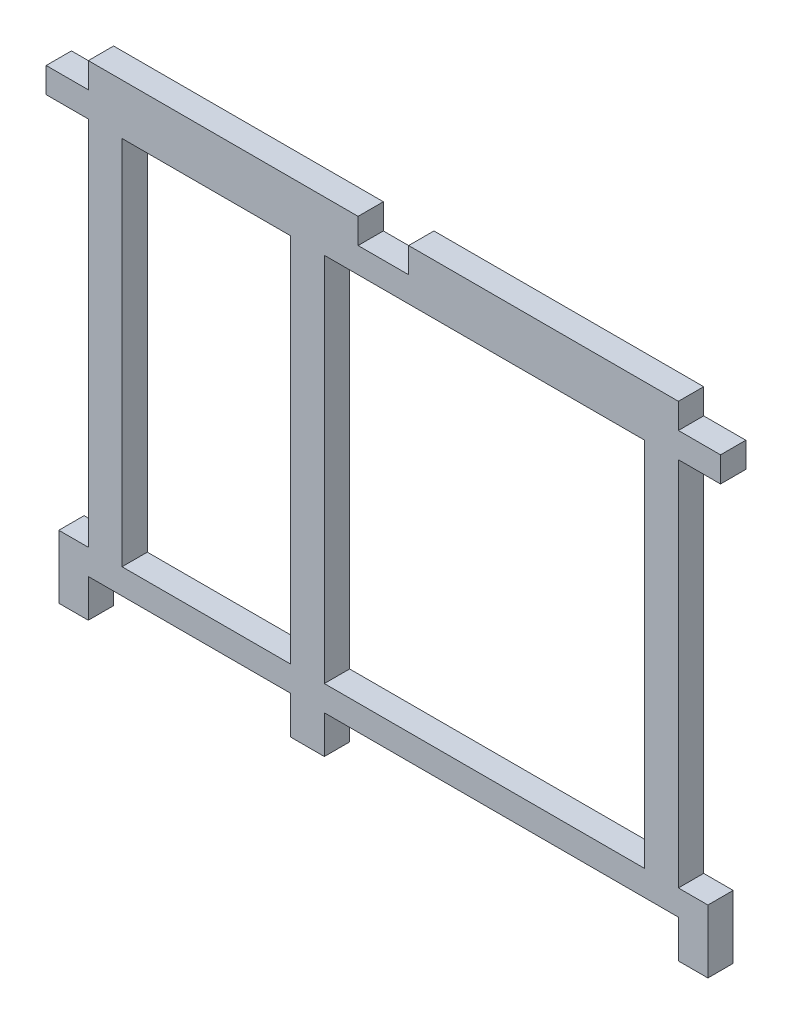
ISO-10303-21;
HEADER;
FILE_DESCRIPTION(('STEP AP214'),'2;1');
FILE_NAME('part.step','',(''),(''),'','','');
FILE_SCHEMA(('AUTOMOTIVE_DESIGN { 1 0 10303 214 1 1 1 1 }'));
ENDSEC;
DATA;
#1=APPLICATION_CONTEXT('core data for automotive mechanical design processes');
#2=APPLICATION_PROTOCOL_DEFINITION('international standard','automotive_design',2000,#1);
#3=PRODUCT_CONTEXT('',#1,'mechanical');
#4=PRODUCT('Part','Part','',(#3));
#5=PRODUCT_RELATED_PRODUCT_CATEGORY('part','',(#4));
#6=PRODUCT_DEFINITION_FORMATION('','',#4);
#7=PRODUCT_DEFINITION_CONTEXT('part definition',#1,'design');
#8=PRODUCT_DEFINITION('design','',#6,#7);
#9=PRODUCT_DEFINITION_SHAPE('','',#8);
#10=(LENGTH_UNIT() NAMED_UNIT(*) SI_UNIT(.MILLI.,.METRE.));
#11=(NAMED_UNIT(*) PLANE_ANGLE_UNIT() SI_UNIT($,.RADIAN.));
#12=(NAMED_UNIT(*) SI_UNIT($,.STERADIAN.) SOLID_ANGLE_UNIT());
#13=UNCERTAINTY_MEASURE_WITH_UNIT(LENGTH_MEASURE(1.E-05),#10,'distance_accuracy_value','');
#14=(GEOMETRIC_REPRESENTATION_CONTEXT(3) GLOBAL_UNCERTAINTY_ASSIGNED_CONTEXT((#13)) GLOBAL_UNIT_ASSIGNED_CONTEXT((#10,
#11,#12)) REPRESENTATION_CONTEXT('',''));
#15=CARTESIAN_POINT('',(0.,0.,0.));
#16=DIRECTION('',(0.,0.,1.));
#17=DIRECTION('',(1.,0.,0.));
#18=AXIS2_PLACEMENT_3D('',#15,#16,#17);
#19=CARTESIAN_POINT('',(0.,0.,3.));
#20=DIRECTION('',(0.,0.,1.));
#21=DIRECTION('',(1.,0.,0.));
#22=AXIS2_PLACEMENT_3D('',#19,#20,#21);
#23=PLANE('',#22);
#24=DIRECTION('',(0.,-1.,0.));
#25=VECTOR('',#24,1.);
#26=CARTESIAN_POINT('',(5.,-3.,3.));
#27=LINE('',#26,#25);
#28=CARTESIAN_POINT('',(5.,-3.,3.));
#29=VERTEX_POINT('',#28);
#30=CARTESIAN_POINT('',(5.,-47.,3.));
#31=VERTEX_POINT('',#30);
#32=EDGE_CURVE('E335',#29,#31,#27,.T.);
#33=ORIENTED_EDGE('',*,*,#32,.T.);
#34=DIRECTION('',(-1.,0.,0.));
#35=VECTOR('',#34,1.);
#36=CARTESIAN_POINT('',(1.5,-47.,3.));
#37=LINE('',#36,#35);
#38=CARTESIAN_POINT('',(1.5,-47.,3.));
#39=VERTEX_POINT('',#38);
#40=EDGE_CURVE('E338',#31,#39,#37,.T.);
#41=ORIENTED_EDGE('',*,*,#40,.T.);
#42=DIRECTION('',(0.,-1.,0.));
#43=VECTOR('',#42,1.);
#44=CARTESIAN_POINT('',(1.5,-54.5,3.));
#45=LINE('',#44,#43);
#46=CARTESIAN_POINT('',(1.5,-54.5,3.));
#47=VERTEX_POINT('',#46);
#48=EDGE_CURVE('E341',#39,#47,#45,.T.);
#49=ORIENTED_EDGE('',*,*,#48,.T.);
#50=DIRECTION('',(1.,0.,0.));
#51=VECTOR('',#50,1.);
#52=CARTESIAN_POINT('',(5.,-54.5,3.));
#53=LINE('',#52,#51);
#54=CARTESIAN_POINT('',(5.,-54.5,3.));
#55=VERTEX_POINT('',#54);
#56=EDGE_CURVE('E343',#47,#55,#53,.T.);
#57=ORIENTED_EDGE('',*,*,#56,.T.);
#58=DIRECTION('',(0.,1.,0.));
#59=VECTOR('',#58,1.);
#60=CARTESIAN_POINT('',(5.,-50.,3.));
#61=LINE('',#60,#59);
#62=CARTESIAN_POINT('',(5.,-50.,3.));
#63=VERTEX_POINT('',#62);
#64=EDGE_CURVE('E345',#55,#63,#61,.T.);
#65=ORIENTED_EDGE('',*,*,#64,.T.);
#66=DIRECTION('',(1.,0.,0.));
#67=VECTOR('',#66,1.);
#68=CARTESIAN_POINT('',(29.,-50.,3.));
#69=LINE('',#68,#67);
#70=CARTESIAN_POINT('',(29.,-50.,3.));
#71=VERTEX_POINT('',#70);
#72=EDGE_CURVE('E347',#63,#71,#69,.T.);
#73=ORIENTED_EDGE('',*,*,#72,.T.);
#74=DIRECTION('',(0.,-1.,0.));
#75=VECTOR('',#74,1.);
#76=CARTESIAN_POINT('',(29.,-54.5,3.));
#77=LINE('',#76,#75);
#78=CARTESIAN_POINT('',(29.,-54.5,3.));
#79=VERTEX_POINT('',#78);
#80=EDGE_CURVE('E349',#71,#79,#77,.T.);
#81=ORIENTED_EDGE('',*,*,#80,.T.);
#82=DIRECTION('',(1.,0.,0.));
#83=VECTOR('',#82,1.);
#84=CARTESIAN_POINT('',(33.,-54.5,3.));
#85=LINE('',#84,#83);
#86=CARTESIAN_POINT('',(33.,-54.5,3.));
#87=VERTEX_POINT('',#86);
#88=EDGE_CURVE('E351',#79,#87,#85,.T.);
#89=ORIENTED_EDGE('',*,*,#88,.T.);
#90=DIRECTION('',(0.,1.,0.));
#91=VECTOR('',#90,1.);
#92=CARTESIAN_POINT('',(33.,-50.,3.));
#93=LINE('',#92,#91);
#94=CARTESIAN_POINT('',(33.,-50.,3.));
#95=VERTEX_POINT('',#94);
#96=EDGE_CURVE('E353',#87,#95,#93,.T.);
#97=ORIENTED_EDGE('',*,*,#96,.T.);
#98=DIRECTION('',(1.,0.,0.));
#99=VECTOR('',#98,1.);
#100=CARTESIAN_POINT('',(75.,-50.,3.));
#101=LINE('',#100,#99);
#102=CARTESIAN_POINT('',(75.,-50.,3.));
#103=VERTEX_POINT('',#102);
#104=EDGE_CURVE('E355',#95,#103,#101,.T.);
#105=ORIENTED_EDGE('',*,*,#104,.T.);
#106=DIRECTION('',(0.,-1.,0.));
#107=VECTOR('',#106,1.);
#108=CARTESIAN_POINT('',(75.,-54.5,3.));
#109=LINE('',#108,#107);
#110=CARTESIAN_POINT('',(75.,-54.5,3.));
#111=VERTEX_POINT('',#110);
#112=EDGE_CURVE('E357',#103,#111,#109,.T.);
#113=ORIENTED_EDGE('',*,*,#112,.T.);
#114=DIRECTION('',(1.,0.,0.));
#115=VECTOR('',#114,1.);
#116=CARTESIAN_POINT('',(78.5,-54.5,3.));
#117=LINE('',#116,#115);
#118=CARTESIAN_POINT('',(78.5,-54.5,3.));
#119=VERTEX_POINT('',#118);
#120=EDGE_CURVE('E359',#111,#119,#117,.T.);
#121=ORIENTED_EDGE('',*,*,#120,.T.);
#122=DIRECTION('',(0.,1.,0.));
#123=VECTOR('',#122,1.);
#124=CARTESIAN_POINT('',(78.5,-47.,3.));
#125=LINE('',#124,#123);
#126=CARTESIAN_POINT('',(78.5,-47.,3.));
#127=VERTEX_POINT('',#126);
#128=EDGE_CURVE('E361',#119,#127,#125,.T.);
#129=ORIENTED_EDGE('',*,*,#128,.T.);
#130=DIRECTION('',(-1.,0.,0.));
#131=VECTOR('',#130,1.);
#132=CARTESIAN_POINT('',(75.,-47.,3.));
#133=LINE('',#132,#131);
#134=CARTESIAN_POINT('',(75.,-47.,3.));
#135=VERTEX_POINT('',#134);
#136=EDGE_CURVE('E363',#127,#135,#133,.T.);
#137=ORIENTED_EDGE('',*,*,#136,.T.);
#138=DIRECTION('',(0.,1.,0.));
#139=VECTOR('',#138,1.);
#140=CARTESIAN_POINT('',(75.,-2.99999999999999,3.));
#141=LINE('',#140,#139);
#142=CARTESIAN_POINT('',(75.,-2.99999999999999,3.));
#143=VERTEX_POINT('',#142);
#144=EDGE_CURVE('E365',#135,#143,#141,.T.);
#145=ORIENTED_EDGE('',*,*,#144,.T.);
#146=DIRECTION('',(1.,0.,0.));
#147=VECTOR('',#146,1.);
#148=CARTESIAN_POINT('',(80.,-2.99999999999999,3.));
#149=LINE('',#148,#147);
#150=CARTESIAN_POINT('',(80.,-2.99999999999999,3.));
#151=VERTEX_POINT('',#150);
#152=EDGE_CURVE('E367',#143,#151,#149,.T.);
#153=ORIENTED_EDGE('',*,*,#152,.T.);
#154=DIRECTION('',(0.,1.,0.));
#155=VECTOR('',#154,1.);
#156=CARTESIAN_POINT('',(80.,0.,3.));
#157=LINE('',#156,#155);
#158=CARTESIAN_POINT('',(80.,0.,3.));
#159=VERTEX_POINT('',#158);
#160=EDGE_CURVE('E369',#151,#159,#157,.T.);
#161=ORIENTED_EDGE('',*,*,#160,.T.);
#162=DIRECTION('',(-1.,0.,0.));
#163=VECTOR('',#162,1.);
#164=CARTESIAN_POINT('',(75.,0.,3.));
#165=LINE('',#164,#163);
#166=CARTESIAN_POINT('',(75.,0.,3.));
#167=VERTEX_POINT('',#166);
#168=EDGE_CURVE('E371',#159,#167,#165,.T.);
#169=ORIENTED_EDGE('',*,*,#168,.T.);
#170=DIRECTION('',(0.,1.,0.));
#171=VECTOR('',#170,1.);
#172=CARTESIAN_POINT('',(75.,3.,3.));
#173=LINE('',#172,#171);
#174=CARTESIAN_POINT('',(75.,3.,3.));
#175=VERTEX_POINT('',#174);
#176=EDGE_CURVE('E373',#167,#175,#173,.T.);
#177=ORIENTED_EDGE('',*,*,#176,.T.);
#178=DIRECTION('',(-1.,0.,0.));
#179=VECTOR('',#178,1.);
#180=CARTESIAN_POINT('',(43.,3.,3.));
#181=LINE('',#180,#179);
#182=CARTESIAN_POINT('',(43.,3.,3.));
#183=VERTEX_POINT('',#182);
#184=EDGE_CURVE('E375',#175,#183,#181,.T.);
#185=ORIENTED_EDGE('',*,*,#184,.T.);
#186=DIRECTION('',(0.,-1.,0.));
#187=VECTOR('',#186,1.);
#188=CARTESIAN_POINT('',(43.,0.,3.));
#189=LINE('',#188,#187);
#190=CARTESIAN_POINT('',(43.,0.,3.));
#191=VERTEX_POINT('',#190);
#192=EDGE_CURVE('E377',#183,#191,#189,.T.);
#193=ORIENTED_EDGE('',*,*,#192,.T.);
#194=DIRECTION('',(-1.,0.,0.));
#195=VECTOR('',#194,1.);
#196=CARTESIAN_POINT('',(37.,0.,3.));
#197=LINE('',#196,#195);
#198=CARTESIAN_POINT('',(37.,0.,3.));
#199=VERTEX_POINT('',#198);
#200=EDGE_CURVE('E379',#191,#199,#197,.T.);
#201=ORIENTED_EDGE('',*,*,#200,.T.);
#202=DIRECTION('',(0.,1.,0.));
#203=VECTOR('',#202,1.);
#204=CARTESIAN_POINT('',(37.,3.,3.));
#205=LINE('',#204,#203);
#206=CARTESIAN_POINT('',(37.,3.,3.));
#207=VERTEX_POINT('',#206);
#208=EDGE_CURVE('E381',#199,#207,#205,.T.);
#209=ORIENTED_EDGE('',*,*,#208,.T.);
#210=DIRECTION('',(-1.,0.,0.));
#211=VECTOR('',#210,1.);
#212=CARTESIAN_POINT('',(5.,3.,3.));
#213=LINE('',#212,#211);
#214=CARTESIAN_POINT('',(5.,3.,3.));
#215=VERTEX_POINT('',#214);
#216=EDGE_CURVE('E383',#207,#215,#213,.T.);
#217=ORIENTED_EDGE('',*,*,#216,.T.);
#218=DIRECTION('',(0.,-1.,0.));
#219=VECTOR('',#218,1.);
#220=CARTESIAN_POINT('',(5.,0.,3.));
#221=LINE('',#220,#219);
#222=CARTESIAN_POINT('',(5.,0.,3.));
#223=VERTEX_POINT('',#222);
#224=EDGE_CURVE('E385',#215,#223,#221,.T.);
#225=ORIENTED_EDGE('',*,*,#224,.T.);
#226=DIRECTION('',(-1.,0.,0.));
#227=VECTOR('',#226,1.);
#228=CARTESIAN_POINT('',(0.,0.,3.));
#229=LINE('',#228,#227);
#230=CARTESIAN_POINT('',(0.,0.,3.));
#231=VERTEX_POINT('',#230);
#232=EDGE_CURVE('E387',#223,#231,#229,.T.);
#233=ORIENTED_EDGE('',*,*,#232,.T.);
#234=DIRECTION('',(0.,-1.,0.));
#235=VECTOR('',#234,1.);
#236=CARTESIAN_POINT('',(0.,-3.,3.));
#237=LINE('',#236,#235);
#238=CARTESIAN_POINT('',(0.,-3.,3.));
#239=VERTEX_POINT('',#238);
#240=EDGE_CURVE('E389',#231,#239,#237,.T.);
#241=ORIENTED_EDGE('',*,*,#240,.T.);
#242=DIRECTION('',(1.,0.,0.));
#243=VECTOR('',#242,1.);
#244=CARTESIAN_POINT('',(5.,-3.,3.));
#245=LINE('',#244,#243);
#246=EDGE_CURVE('E391',#239,#29,#245,.T.);
#247=ORIENTED_EDGE('',*,*,#246,.T.);
#248=EDGE_LOOP('',(#33,#41,#49,#57,#65,#73,#81,#89,#97,#105,#113,#121,#129,#137,#145,#153,#161,
#169,#177,#185,#193,#201,#209,#217,#225,#233,#241,#247));
#249=FACE_BOUND('',#248,.T.);
#250=DIRECTION('',(1.,0.,0.));
#251=VECTOR('',#250,1.);
#252=CARTESIAN_POINT('',(9.00000000000001,-47.,3.));
#253=LINE('',#252,#251);
#254=CARTESIAN_POINT('',(9.00000000000001,-47.,3.));
#255=VERTEX_POINT('',#254);
#256=CARTESIAN_POINT('',(29.,-47.,3.));
#257=VERTEX_POINT('',#256);
#258=EDGE_CURVE('E306',#255,#257,#253,.T.);
#259=ORIENTED_EDGE('',*,*,#258,.F.);
#260=DIRECTION('',(0.,-1.,0.));
#261=VECTOR('',#260,1.);
#262=CARTESIAN_POINT('',(9.00000000000001,-3.,3.));
#263=LINE('',#262,#261);
#264=CARTESIAN_POINT('',(9.00000000000001,-3.,3.));
#265=VERTEX_POINT('',#264);
#266=EDGE_CURVE('E304',#265,#255,#263,.T.);
#267=ORIENTED_EDGE('',*,*,#266,.F.);
#268=DIRECTION('',(-1.,0.,0.));
#269=VECTOR('',#268,1.);
#270=CARTESIAN_POINT('',(29.,-3.,3.));
#271=LINE('',#270,#269);
#272=CARTESIAN_POINT('',(29.,-3.,3.));
#273=VERTEX_POINT('',#272);
#274=EDGE_CURVE('E312',#273,#265,#271,.T.);
#275=ORIENTED_EDGE('',*,*,#274,.F.);
#276=DIRECTION('',(0.,1.,0.));
#277=VECTOR('',#276,1.);
#278=CARTESIAN_POINT('',(29.,-47.,3.));
#279=LINE('',#278,#277);
#280=EDGE_CURVE('E309',#257,#273,#279,.T.);
#281=ORIENTED_EDGE('',*,*,#280,.F.);
#282=EDGE_LOOP('',(#259,#267,#275,#281));
#283=FACE_BOUND('',#282,.T.);
#284=DIRECTION('',(0.,-1.,0.));
#285=VECTOR('',#284,1.);
#286=CARTESIAN_POINT('',(33.,-2.99999999999999,3.));
#287=LINE('',#286,#285);
#288=CARTESIAN_POINT('',(33.,-2.99999999999999,3.));
#289=VERTEX_POINT('',#288);
#290=CARTESIAN_POINT('',(33.,-47.,3.));
#291=VERTEX_POINT('',#290);
#292=EDGE_CURVE('E276',#289,#291,#287,.T.);
#293=ORIENTED_EDGE('',*,*,#292,.F.);
#294=DIRECTION('',(-1.,0.,0.));
#295=VECTOR('',#294,1.);
#296=CARTESIAN_POINT('',(71.,-2.99999999999998,3.));
#297=LINE('',#296,#295);
#298=CARTESIAN_POINT('',(71.,-2.99999999999998,3.));
#299=VERTEX_POINT('',#298);
#300=EDGE_CURVE('E268',#299,#289,#297,.T.);
#301=ORIENTED_EDGE('',*,*,#300,.F.);
#302=DIRECTION('',(0.,1.,0.));
#303=VECTOR('',#302,1.);
#304=CARTESIAN_POINT('',(71.,-47.,3.));
#305=LINE('',#304,#303);
#306=CARTESIAN_POINT('',(71.,-47.,3.));
#307=VERTEX_POINT('',#306);
#308=EDGE_CURVE('E290',#307,#299,#305,.T.);
#309=ORIENTED_EDGE('',*,*,#308,.F.);
#310=DIRECTION('',(1.,0.,0.));
#311=VECTOR('',#310,1.);
#312=CARTESIAN_POINT('',(33.,-47.,3.));
#313=LINE('',#312,#311);
#314=EDGE_CURVE('E288',#291,#307,#313,.T.);
#315=ORIENTED_EDGE('',*,*,#314,.F.);
#316=EDGE_LOOP('',(#293,#301,#309,#315));
#317=FACE_BOUND('',#316,.T.);
#318=ADVANCED_FACE('F35',(#249,#283,#317),#23,.T.);
#319=CARTESIAN_POINT('',(0.,0.,0.));
#320=DIRECTION('',(0.,0.,1.));
#321=DIRECTION('',(1.,0.,0.));
#322=AXIS2_PLACEMENT_3D('',#319,#320,#321);
#323=PLANE('',#322);
#324=DIRECTION('',(0.,-1.,0.));
#325=VECTOR('',#324,1.);
#326=CARTESIAN_POINT('',(9.00000000000001,-3.,0.));
#327=LINE('',#326,#325);
#328=CARTESIAN_POINT('',(9.00000000000001,-3.,0.));
#329=VERTEX_POINT('',#328);
#330=CARTESIAN_POINT('',(9.00000000000001,-47.,0.));
#331=VERTEX_POINT('',#330);
#332=EDGE_CURVE('E284',#329,#331,#327,.T.);
#333=ORIENTED_EDGE('',*,*,#332,.T.);
#334=DIRECTION('',(1.,0.,0.));
#335=VECTOR('',#334,1.);
#336=CARTESIAN_POINT('',(9.00000000000001,-47.,0.));
#337=LINE('',#336,#335);
#338=CARTESIAN_POINT('',(29.,-47.,0.));
#339=VERTEX_POINT('',#338);
#340=EDGE_CURVE('E317',#331,#339,#337,.T.);
#341=ORIENTED_EDGE('',*,*,#340,.T.);
#342=DIRECTION('',(0.,1.,0.));
#343=VECTOR('',#342,1.);
#344=CARTESIAN_POINT('',(29.,-47.,0.));
#345=LINE('',#344,#343);
#346=CARTESIAN_POINT('',(29.,-3.,0.));
#347=VERTEX_POINT('',#346);
#348=EDGE_CURVE('E320',#339,#347,#345,.T.);
#349=ORIENTED_EDGE('',*,*,#348,.T.);
#350=DIRECTION('',(-1.,0.,0.));
#351=VECTOR('',#350,1.);
#352=CARTESIAN_POINT('',(29.,-3.,0.));
#353=LINE('',#352,#351);
#354=EDGE_CURVE('E307',#347,#329,#353,.T.);
#355=ORIENTED_EDGE('',*,*,#354,.T.);
#356=EDGE_LOOP('',(#333,#341,#349,#355));
#357=FACE_BOUND('',#356,.T.);
#358=DIRECTION('',(0.,-1.,0.));
#359=VECTOR('',#358,1.);
#360=CARTESIAN_POINT('',(5.,-3.,0.));
#361=LINE('',#360,#359);
#362=CARTESIAN_POINT('',(5.,-3.,0.));
#363=VERTEX_POINT('',#362);
#364=CARTESIAN_POINT('',(5.,-47.,0.));
#365=VERTEX_POINT('',#364);
#366=EDGE_CURVE('E334',#363,#365,#361,.T.);
#367=ORIENTED_EDGE('',*,*,#366,.F.);
#368=DIRECTION('',(1.,0.,0.));
#369=VECTOR('',#368,1.);
#370=CARTESIAN_POINT('',(5.,-3.,0.));
#371=LINE('',#370,#369);
#372=CARTESIAN_POINT('',(0.,-3.,0.));
#373=VERTEX_POINT('',#372);
#374=EDGE_CURVE('E339',#373,#363,#371,.T.);
#375=ORIENTED_EDGE('',*,*,#374,.F.);
#376=DIRECTION('',(0.,-1.,0.));
#377=VECTOR('',#376,1.);
#378=CARTESIAN_POINT('',(0.,-3.,0.));
#379=LINE('',#378,#377);
#380=CARTESIAN_POINT('',(0.,0.,0.));
#381=VERTEX_POINT('',#380);
#382=EDGE_CURVE('E446',#381,#373,#379,.T.);
#383=ORIENTED_EDGE('',*,*,#382,.F.);
#384=DIRECTION('',(-1.,0.,0.));
#385=VECTOR('',#384,1.);
#386=CARTESIAN_POINT('',(0.,0.,0.));
#387=LINE('',#386,#385);
#388=CARTESIAN_POINT('',(5.,0.,0.));
#389=VERTEX_POINT('',#388);
#390=EDGE_CURVE('E444',#389,#381,#387,.T.);
#391=ORIENTED_EDGE('',*,*,#390,.F.);
#392=DIRECTION('',(0.,-1.,0.));
#393=VECTOR('',#392,1.);
#394=CARTESIAN_POINT('',(5.,0.,0.));
#395=LINE('',#394,#393);
#396=CARTESIAN_POINT('',(5.,3.,0.));
#397=VERTEX_POINT('',#396);
#398=EDGE_CURVE('E442',#397,#389,#395,.T.);
#399=ORIENTED_EDGE('',*,*,#398,.F.);
#400=DIRECTION('',(-1.,0.,0.));
#401=VECTOR('',#400,1.);
#402=CARTESIAN_POINT('',(5.,3.,0.));
#403=LINE('',#402,#401);
#404=CARTESIAN_POINT('',(37.,3.,0.));
#405=VERTEX_POINT('',#404);
#406=EDGE_CURVE('E440',#405,#397,#403,.T.);
#407=ORIENTED_EDGE('',*,*,#406,.F.);
#408=DIRECTION('',(0.,1.,0.));
#409=VECTOR('',#408,1.);
#410=CARTESIAN_POINT('',(37.,3.,0.));
#411=LINE('',#410,#409);
#412=CARTESIAN_POINT('',(37.,0.,0.));
#413=VERTEX_POINT('',#412);
#414=EDGE_CURVE('E438',#413,#405,#411,.T.);
#415=ORIENTED_EDGE('',*,*,#414,.F.);
#416=DIRECTION('',(-1.,0.,0.));
#417=VECTOR('',#416,1.);
#418=CARTESIAN_POINT('',(37.,0.,0.));
#419=LINE('',#418,#417);
#420=CARTESIAN_POINT('',(43.,0.,0.));
#421=VERTEX_POINT('',#420);
#422=EDGE_CURVE('E436',#421,#413,#419,.T.);
#423=ORIENTED_EDGE('',*,*,#422,.F.);
#424=DIRECTION('',(0.,-1.,0.));
#425=VECTOR('',#424,1.);
#426=CARTESIAN_POINT('',(43.,0.,0.));
#427=LINE('',#426,#425);
#428=CARTESIAN_POINT('',(43.,3.,0.));
#429=VERTEX_POINT('',#428);
#430=EDGE_CURVE('E434',#429,#421,#427,.T.);
#431=ORIENTED_EDGE('',*,*,#430,.F.);
#432=DIRECTION('',(-1.,0.,0.));
#433=VECTOR('',#432,1.);
#434=CARTESIAN_POINT('',(43.,3.,0.));
#435=LINE('',#434,#433);
#436=CARTESIAN_POINT('',(75.,3.,0.));
#437=VERTEX_POINT('',#436);
#438=EDGE_CURVE('E432',#437,#429,#435,.T.);
#439=ORIENTED_EDGE('',*,*,#438,.F.);
#440=DIRECTION('',(0.,1.,0.));
#441=VECTOR('',#440,1.);
#442=CARTESIAN_POINT('',(75.,3.,0.));
#443=LINE('',#442,#441);
#444=CARTESIAN_POINT('',(75.,0.,0.));
#445=VERTEX_POINT('',#444);
#446=EDGE_CURVE('E430',#445,#437,#443,.T.);
#447=ORIENTED_EDGE('',*,*,#446,.F.);
#448=DIRECTION('',(-1.,0.,0.));
#449=VECTOR('',#448,1.);
#450=CARTESIAN_POINT('',(75.,0.,0.));
#451=LINE('',#450,#449);
#452=CARTESIAN_POINT('',(80.,0.,0.));
#453=VERTEX_POINT('',#452);
#454=EDGE_CURVE('E428',#453,#445,#451,.T.);
#455=ORIENTED_EDGE('',*,*,#454,.F.);
#456=DIRECTION('',(0.,1.,0.));
#457=VECTOR('',#456,1.);
#458=CARTESIAN_POINT('',(80.,0.,0.));
#459=LINE('',#458,#457);
#460=CARTESIAN_POINT('',(80.,-2.99999999999999,0.));
#461=VERTEX_POINT('',#460);
#462=EDGE_CURVE('E426',#461,#453,#459,.T.);
#463=ORIENTED_EDGE('',*,*,#462,.F.);
#464=DIRECTION('',(1.,0.,0.));
#465=VECTOR('',#464,1.);
#466=CARTESIAN_POINT('',(80.,-2.99999999999999,0.));
#467=LINE('',#466,#465);
#468=CARTESIAN_POINT('',(75.,-2.99999999999999,0.));
#469=VERTEX_POINT('',#468);
#470=EDGE_CURVE('E424',#469,#461,#467,.T.);
#471=ORIENTED_EDGE('',*,*,#470,.F.);
#472=DIRECTION('',(0.,1.,0.));
#473=VECTOR('',#472,1.);
#474=CARTESIAN_POINT('',(75.,-2.99999999999999,0.));
#475=LINE('',#474,#473);
#476=CARTESIAN_POINT('',(75.,-47.,0.));
#477=VERTEX_POINT('',#476);
#478=EDGE_CURVE('E422',#477,#469,#475,.T.);
#479=ORIENTED_EDGE('',*,*,#478,.F.);
#480=DIRECTION('',(-1.,0.,0.));
#481=VECTOR('',#480,1.);
#482=CARTESIAN_POINT('',(75.,-47.,0.));
#483=LINE('',#482,#481);
#484=CARTESIAN_POINT('',(78.5,-47.,0.));
#485=VERTEX_POINT('',#484);
#486=EDGE_CURVE('E420',#485,#477,#483,.T.);
#487=ORIENTED_EDGE('',*,*,#486,.F.);
#488=DIRECTION('',(0.,1.,0.));
#489=VECTOR('',#488,1.);
#490=CARTESIAN_POINT('',(78.5,-47.,0.));
#491=LINE('',#490,#489);
#492=CARTESIAN_POINT('',(78.5,-54.5,0.));
#493=VERTEX_POINT('',#492);
#494=EDGE_CURVE('E418',#493,#485,#491,.T.);
#495=ORIENTED_EDGE('',*,*,#494,.F.);
#496=DIRECTION('',(1.,0.,0.));
#497=VECTOR('',#496,1.);
#498=CARTESIAN_POINT('',(78.5,-54.5,0.));
#499=LINE('',#498,#497);
#500=CARTESIAN_POINT('',(75.,-54.5,0.));
#501=VERTEX_POINT('',#500);
#502=EDGE_CURVE('E416',#501,#493,#499,.T.);
#503=ORIENTED_EDGE('',*,*,#502,.F.);
#504=DIRECTION('',(0.,-1.,0.));
#505=VECTOR('',#504,1.);
#506=CARTESIAN_POINT('',(75.,-54.5,0.));
#507=LINE('',#506,#505);
#508=CARTESIAN_POINT('',(75.,-50.,0.));
#509=VERTEX_POINT('',#508);
#510=EDGE_CURVE('E414',#509,#501,#507,.T.);
#511=ORIENTED_EDGE('',*,*,#510,.F.);
#512=DIRECTION('',(1.,0.,0.));
#513=VECTOR('',#512,1.);
#514=CARTESIAN_POINT('',(75.,-50.,0.));
#515=LINE('',#514,#513);
#516=CARTESIAN_POINT('',(33.,-50.,0.));
#517=VERTEX_POINT('',#516);
#518=EDGE_CURVE('E412',#517,#509,#515,.T.);
#519=ORIENTED_EDGE('',*,*,#518,.F.);
#520=DIRECTION('',(0.,1.,0.));
#521=VECTOR('',#520,1.);
#522=CARTESIAN_POINT('',(33.,-50.,0.));
#523=LINE('',#522,#521);
#524=CARTESIAN_POINT('',(33.,-54.5,0.));
#525=VERTEX_POINT('',#524);
#526=EDGE_CURVE('E410',#525,#517,#523,.T.);
#527=ORIENTED_EDGE('',*,*,#526,.F.);
#528=DIRECTION('',(1.,0.,0.));
#529=VECTOR('',#528,1.);
#530=CARTESIAN_POINT('',(33.,-54.5,0.));
#531=LINE('',#530,#529);
#532=CARTESIAN_POINT('',(29.,-54.5,0.));
#533=VERTEX_POINT('',#532);
#534=EDGE_CURVE('E408',#533,#525,#531,.T.);
#535=ORIENTED_EDGE('',*,*,#534,.F.);
#536=DIRECTION('',(0.,-1.,0.));
#537=VECTOR('',#536,1.);
#538=CARTESIAN_POINT('',(29.,-54.5,0.));
#539=LINE('',#538,#537);
#540=CARTESIAN_POINT('',(29.,-50.,0.));
#541=VERTEX_POINT('',#540);
#542=EDGE_CURVE('E406',#541,#533,#539,.T.);
#543=ORIENTED_EDGE('',*,*,#542,.F.);
#544=DIRECTION('',(1.,0.,0.));
#545=VECTOR('',#544,1.);
#546=CARTESIAN_POINT('',(29.,-50.,0.));
#547=LINE('',#546,#545);
#548=CARTESIAN_POINT('',(5.,-50.,0.));
#549=VERTEX_POINT('',#548);
#550=EDGE_CURVE('E404',#549,#541,#547,.T.);
#551=ORIENTED_EDGE('',*,*,#550,.F.);
#552=DIRECTION('',(0.,1.,0.));
#553=VECTOR('',#552,1.);
#554=CARTESIAN_POINT('',(5.,-50.,0.));
#555=LINE('',#554,#553);
#556=CARTESIAN_POINT('',(5.,-54.5,0.));
#557=VERTEX_POINT('',#556);
#558=EDGE_CURVE('E402',#557,#549,#555,.T.);
#559=ORIENTED_EDGE('',*,*,#558,.F.);
#560=DIRECTION('',(1.,0.,0.));
#561=VECTOR('',#560,1.);
#562=CARTESIAN_POINT('',(5.,-54.5,0.));
#563=LINE('',#562,#561);
#564=CARTESIAN_POINT('',(1.5,-54.5,0.));
#565=VERTEX_POINT('',#564);
#566=EDGE_CURVE('E400',#565,#557,#563,.T.);
#567=ORIENTED_EDGE('',*,*,#566,.F.);
#568=DIRECTION('',(0.,-1.,0.));
#569=VECTOR('',#568,1.);
#570=CARTESIAN_POINT('',(1.5,-54.5,0.));
#571=LINE('',#570,#569);
#572=CARTESIAN_POINT('',(1.5,-47.,0.));
#573=VERTEX_POINT('',#572);
#574=EDGE_CURVE('E398',#573,#565,#571,.T.);
#575=ORIENTED_EDGE('',*,*,#574,.F.);
#576=DIRECTION('',(-1.,0.,0.));
#577=VECTOR('',#576,1.);
#578=CARTESIAN_POINT('',(1.5,-47.,0.));
#579=LINE('',#578,#577);
#580=EDGE_CURVE('E396',#365,#573,#579,.T.);
#581=ORIENTED_EDGE('',*,*,#580,.F.);
#582=EDGE_LOOP('',(#367,#375,#383,#391,#399,#407,#415,#423,#431,#439,#447,#455,#463,#471,#479,
#487,#495,#503,#511,#519,#527,#535,#543,#551,#559,#567,#575,#581));
#583=FACE_BOUND('',#582,.T.);
#584=DIRECTION('',(-1.,0.,0.));
#585=VECTOR('',#584,1.);
#586=CARTESIAN_POINT('',(71.,-2.99999999999998,0.));
#587=LINE('',#586,#585);
#588=CARTESIAN_POINT('',(71.,-2.99999999999998,0.));
#589=VERTEX_POINT('',#588);
#590=CARTESIAN_POINT('',(33.,-2.99999999999999,0.));
#591=VERTEX_POINT('',#590);
#592=EDGE_CURVE('E58',#589,#591,#587,.T.);
#593=ORIENTED_EDGE('',*,*,#592,.T.);
#594=DIRECTION('',(0.,-1.,0.));
#595=VECTOR('',#594,1.);
#596=CARTESIAN_POINT('',(33.,-2.99999999999999,0.));
#597=LINE('',#596,#595);
#598=CARTESIAN_POINT('',(33.,-47.,0.));
#599=VERTEX_POINT('',#598);
#600=EDGE_CURVE('E283',#591,#599,#597,.T.);
#601=ORIENTED_EDGE('',*,*,#600,.T.);
#602=DIRECTION('',(1.,0.,0.));
#603=VECTOR('',#602,1.);
#604=CARTESIAN_POINT('',(33.,-47.,0.));
#605=LINE('',#604,#603);
#606=CARTESIAN_POINT('',(71.,-47.,0.));
#607=VERTEX_POINT('',#606);
#608=EDGE_CURVE('E296',#599,#607,#605,.T.);
#609=ORIENTED_EDGE('',*,*,#608,.T.);
#610=DIRECTION('',(0.,1.,0.));
#611=VECTOR('',#610,1.);
#612=CARTESIAN_POINT('',(71.,-47.,0.));
#613=LINE('',#612,#611);
#614=EDGE_CURVE('E277',#607,#589,#613,.T.);
#615=ORIENTED_EDGE('',*,*,#614,.T.);
#616=EDGE_LOOP('',(#593,#601,#609,#615));
#617=FACE_BOUND('',#616,.T.);
#618=ADVANCED_FACE('F536',(#357,#583,#617),#323,.F.);
#619=CARTESIAN_POINT('',(5.,-3.,3.));
#620=DIRECTION('',(1.,0.,0.));
#621=DIRECTION('',(0.,0.,-1.));
#622=AXIS2_PLACEMENT_3D('',#619,#620,#621);
#623=PLANE('',#622);
#624=ORIENTED_EDGE('',*,*,#366,.T.);
#625=DIRECTION('',(0.,0.,-1.));
#626=VECTOR('',#625,1.);
#627=CARTESIAN_POINT('',(5.,-47.,3.));
#628=LINE('',#627,#626);
#629=EDGE_CURVE('E11',#31,#365,#628,.T.);
#630=ORIENTED_EDGE('',*,*,#629,.F.);
#631=ORIENTED_EDGE('',*,*,#32,.F.);
#632=DIRECTION('',(0.,0.,-1.));
#633=VECTOR('',#632,1.);
#634=CARTESIAN_POINT('',(5.,-3.,3.));
#635=LINE('',#634,#633);
#636=EDGE_CURVE('E393',#29,#363,#635,.T.);
#637=ORIENTED_EDGE('',*,*,#636,.T.);
#638=EDGE_LOOP('',(#624,#630,#631,#637));
#639=FACE_BOUND('',#638,.T.);
#640=ADVANCED_FACE('F37',(#639),#623,.F.);
#641=CARTESIAN_POINT('',(1.5,-47.,3.));
#642=DIRECTION('',(0.,-1.,0.));
#643=DIRECTION('',(1.,0.,0.));
#644=AXIS2_PLACEMENT_3D('',#641,#642,#643);
#645=PLANE('',#644);
#646=ORIENTED_EDGE('',*,*,#580,.T.);
#647=DIRECTION('',(0.,0.,-1.));
#648=VECTOR('',#647,1.);
#649=CARTESIAN_POINT('',(1.5,-47.,3.));
#650=LINE('',#649,#648);
#651=EDGE_CURVE('E43',#39,#573,#650,.T.);
#652=ORIENTED_EDGE('',*,*,#651,.F.);
#653=ORIENTED_EDGE('',*,*,#40,.F.);
#654=ORIENTED_EDGE('',*,*,#629,.T.);
#655=EDGE_LOOP('',(#646,#652,#653,#654));
#656=FACE_BOUND('',#655,.T.);
#657=ADVANCED_FACE('F554',(#656),#645,.F.);
#658=CARTESIAN_POINT('',(1.5,-54.5,3.));
#659=DIRECTION('',(1.,0.,0.));
#660=DIRECTION('',(0.,0.,-1.));
#661=AXIS2_PLACEMENT_3D('',#658,#659,#660);
#662=PLANE('',#661);
#663=ORIENTED_EDGE('',*,*,#574,.T.);
#664=DIRECTION('',(0.,0.,-1.));
#665=VECTOR('',#664,1.);
#666=CARTESIAN_POINT('',(1.5,-54.5,3.));
#667=LINE('',#666,#665);
#668=EDGE_CURVE('E523',#47,#565,#667,.T.);
#669=ORIENTED_EDGE('',*,*,#668,.F.);
#670=ORIENTED_EDGE('',*,*,#48,.F.);
#671=ORIENTED_EDGE('',*,*,#651,.T.);
#672=EDGE_LOOP('',(#663,#669,#670,#671));
#673=FACE_BOUND('',#672,.T.);
#674=ADVANCED_FACE('F530',(#673),#662,.F.);
#675=CARTESIAN_POINT('',(5.,-54.5,3.));
#676=DIRECTION('',(0.,1.,0.));
#677=DIRECTION('',(0.,0.,1.));
#678=AXIS2_PLACEMENT_3D('',#675,#676,#677);
#679=PLANE('',#678);
#680=ORIENTED_EDGE('',*,*,#566,.T.);
#681=DIRECTION('',(0.,0.,-1.));
#682=VECTOR('',#681,1.);
#683=CARTESIAN_POINT('',(5.,-54.5,3.));
#684=LINE('',#683,#682);
#685=EDGE_CURVE('E520',#55,#557,#684,.T.);
#686=ORIENTED_EDGE('',*,*,#685,.F.);
#687=ORIENTED_EDGE('',*,*,#56,.F.);
#688=ORIENTED_EDGE('',*,*,#668,.T.);
#689=EDGE_LOOP('',(#680,#686,#687,#688));
#690=FACE_BOUND('',#689,.T.);
#691=ADVANCED_FACE('F542',(#690),#679,.F.);
#692=CARTESIAN_POINT('',(5.,-50.,3.));
#693=DIRECTION('',(-1.,0.,0.));
#694=DIRECTION('',(0.,0.,1.));
#695=AXIS2_PLACEMENT_3D('',#692,#693,#694);
#696=PLANE('',#695);
#697=ORIENTED_EDGE('',*,*,#558,.T.);
#698=DIRECTION('',(0.,0.,-1.));
#699=VECTOR('',#698,1.);
#700=CARTESIAN_POINT('',(5.,-50.,3.));
#701=LINE('',#700,#699);
#702=EDGE_CURVE('E517',#63,#549,#701,.T.);
#703=ORIENTED_EDGE('',*,*,#702,.F.);
#704=ORIENTED_EDGE('',*,*,#64,.F.);
#705=ORIENTED_EDGE('',*,*,#685,.T.);
#706=EDGE_LOOP('',(#697,#703,#704,#705));
#707=FACE_BOUND('',#706,.T.);
#708=ADVANCED_FACE('F546',(#707),#696,.F.);
#709=CARTESIAN_POINT('',(29.,-50.,3.));
#710=DIRECTION('',(0.,1.,0.));
#711=DIRECTION('',(-1.,0.,0.));
#712=AXIS2_PLACEMENT_3D('',#709,#710,#711);
#713=PLANE('',#712);
#714=ORIENTED_EDGE('',*,*,#550,.T.);
#715=DIRECTION('',(0.,0.,-1.));
#716=VECTOR('',#715,1.);
#717=CARTESIAN_POINT('',(29.,-50.,3.));
#718=LINE('',#717,#716);
#719=EDGE_CURVE('E514',#71,#541,#718,.T.);
#720=ORIENTED_EDGE('',*,*,#719,.F.);
#721=ORIENTED_EDGE('',*,*,#72,.F.);
#722=ORIENTED_EDGE('',*,*,#702,.T.);
#723=EDGE_LOOP('',(#714,#720,#721,#722));
#724=FACE_BOUND('',#723,.T.);
#725=ADVANCED_FACE('F667',(#724),#713,.F.);
#726=CARTESIAN_POINT('',(29.,-54.5,3.));
#727=DIRECTION('',(1.,0.,0.));
#728=DIRECTION('',(0.,0.,-1.));
#729=AXIS2_PLACEMENT_3D('',#726,#727,#728);
#730=PLANE('',#729);
#731=ORIENTED_EDGE('',*,*,#542,.T.);
#732=DIRECTION('',(0.,0.,-1.));
#733=VECTOR('',#732,1.);
#734=CARTESIAN_POINT('',(29.,-54.5,3.));
#735=LINE('',#734,#733);
#736=EDGE_CURVE('E511',#79,#533,#735,.T.);
#737=ORIENTED_EDGE('',*,*,#736,.F.);
#738=ORIENTED_EDGE('',*,*,#80,.F.);
#739=ORIENTED_EDGE('',*,*,#719,.T.);
#740=EDGE_LOOP('',(#731,#737,#738,#739));
#741=FACE_BOUND('',#740,.T.);
#742=ADVANCED_FACE('F664',(#741),#730,.F.);
#743=CARTESIAN_POINT('',(33.,-54.5,3.));
#744=DIRECTION('',(0.,1.,0.));
#745=DIRECTION('',(0.,0.,1.));
#746=AXIS2_PLACEMENT_3D('',#743,#744,#745);
#747=PLANE('',#746);
#748=ORIENTED_EDGE('',*,*,#534,.T.);
#749=DIRECTION('',(0.,0.,-1.));
#750=VECTOR('',#749,1.);
#751=CARTESIAN_POINT('',(33.,-54.5,3.));
#752=LINE('',#751,#750);
#753=EDGE_CURVE('E508',#87,#525,#752,.T.);
#754=ORIENTED_EDGE('',*,*,#753,.F.);
#755=ORIENTED_EDGE('',*,*,#88,.F.);
#756=ORIENTED_EDGE('',*,*,#736,.T.);
#757=EDGE_LOOP('',(#748,#754,#755,#756));
#758=FACE_BOUND('',#757,.T.);
#759=ADVANCED_FACE('F660',(#758),#747,.F.);
#760=CARTESIAN_POINT('',(33.,-50.,3.));
#761=DIRECTION('',(-1.,0.,0.));
#762=DIRECTION('',(0.,0.,1.));
#763=AXIS2_PLACEMENT_3D('',#760,#761,#762);
#764=PLANE('',#763);
#765=ORIENTED_EDGE('',*,*,#526,.T.);
#766=DIRECTION('',(0.,0.,-1.));
#767=VECTOR('',#766,1.);
#768=CARTESIAN_POINT('',(33.,-50.,3.));
#769=LINE('',#768,#767);
#770=EDGE_CURVE('E505',#95,#517,#769,.T.);
#771=ORIENTED_EDGE('',*,*,#770,.F.);
#772=ORIENTED_EDGE('',*,*,#96,.F.);
#773=ORIENTED_EDGE('',*,*,#753,.T.);
#774=EDGE_LOOP('',(#765,#771,#772,#773));
#775=FACE_BOUND('',#774,.T.);
#776=ADVANCED_FACE('F656',(#775),#764,.F.);
#777=CARTESIAN_POINT('',(75.,-50.,3.));
#778=DIRECTION('',(0.,1.,0.));
#779=DIRECTION('',(-1.,0.,0.));
#780=AXIS2_PLACEMENT_3D('',#777,#778,#779);
#781=PLANE('',#780);
#782=ORIENTED_EDGE('',*,*,#518,.T.);
#783=DIRECTION('',(0.,0.,-1.));
#784=VECTOR('',#783,1.);
#785=CARTESIAN_POINT('',(75.,-50.,3.));
#786=LINE('',#785,#784);
#787=EDGE_CURVE('E502',#103,#509,#786,.T.);
#788=ORIENTED_EDGE('',*,*,#787,.F.);
#789=ORIENTED_EDGE('',*,*,#104,.F.);
#790=ORIENTED_EDGE('',*,*,#770,.T.);
#791=EDGE_LOOP('',(#782,#788,#789,#790));
#792=FACE_BOUND('',#791,.T.);
#793=ADVANCED_FACE('F651',(#792),#781,.F.);
#794=CARTESIAN_POINT('',(75.,-54.5,3.));
#795=DIRECTION('',(1.,0.,0.));
#796=DIRECTION('',(0.,0.,-1.));
#797=AXIS2_PLACEMENT_3D('',#794,#795,#796);
#798=PLANE('',#797);
#799=ORIENTED_EDGE('',*,*,#510,.T.);
#800=DIRECTION('',(0.,0.,-1.));
#801=VECTOR('',#800,1.);
#802=CARTESIAN_POINT('',(75.,-54.5,3.));
#803=LINE('',#802,#801);
#804=EDGE_CURVE('E499',#111,#501,#803,.T.);
#805=ORIENTED_EDGE('',*,*,#804,.F.);
#806=ORIENTED_EDGE('',*,*,#112,.F.);
#807=ORIENTED_EDGE('',*,*,#787,.T.);
#808=EDGE_LOOP('',(#799,#805,#806,#807));
#809=FACE_BOUND('',#808,.T.);
#810=ADVANCED_FACE('F645',(#809),#798,.F.);
#811=CARTESIAN_POINT('',(78.5,-54.5,3.));
#812=DIRECTION('',(0.,1.,0.));
#813=DIRECTION('',(0.,0.,1.));
#814=AXIS2_PLACEMENT_3D('',#811,#812,#813);
#815=PLANE('',#814);
#816=ORIENTED_EDGE('',*,*,#502,.T.);
#817=DIRECTION('',(0.,0.,-1.));
#818=VECTOR('',#817,1.);
#819=CARTESIAN_POINT('',(78.5,-54.5,3.));
#820=LINE('',#819,#818);
#821=EDGE_CURVE('E496',#119,#493,#820,.T.);
#822=ORIENTED_EDGE('',*,*,#821,.F.);
#823=ORIENTED_EDGE('',*,*,#120,.F.);
#824=ORIENTED_EDGE('',*,*,#804,.T.);
#825=EDGE_LOOP('',(#816,#822,#823,#824));
#826=FACE_BOUND('',#825,.T.);
#827=ADVANCED_FACE('F641',(#826),#815,.F.);
#828=CARTESIAN_POINT('',(78.5,-47.,3.));
#829=DIRECTION('',(-1.,0.,0.));
#830=DIRECTION('',(0.,0.,1.));
#831=AXIS2_PLACEMENT_3D('',#828,#829,#830);
#832=PLANE('',#831);
#833=ORIENTED_EDGE('',*,*,#494,.T.);
#834=DIRECTION('',(0.,0.,-1.));
#835=VECTOR('',#834,1.);
#836=CARTESIAN_POINT('',(78.5,-47.,3.));
#837=LINE('',#836,#835);
#838=EDGE_CURVE('E493',#127,#485,#837,.T.);
#839=ORIENTED_EDGE('',*,*,#838,.F.);
#840=ORIENTED_EDGE('',*,*,#128,.F.);
#841=ORIENTED_EDGE('',*,*,#821,.T.);
#842=EDGE_LOOP('',(#833,#839,#840,#841));
#843=FACE_BOUND('',#842,.T.);
#844=ADVANCED_FACE('F636',(#843),#832,.F.);
#845=CARTESIAN_POINT('',(75.,-47.,3.));
#846=DIRECTION('',(0.,-1.,0.));
#847=DIRECTION('',(0.,0.,-1.));
#848=AXIS2_PLACEMENT_3D('',#845,#846,#847);
#849=PLANE('',#848);
#850=ORIENTED_EDGE('',*,*,#486,.T.);
#851=DIRECTION('',(0.,0.,-1.));
#852=VECTOR('',#851,1.);
#853=CARTESIAN_POINT('',(75.,-47.,3.));
#854=LINE('',#853,#852);
#855=EDGE_CURVE('E490',#135,#477,#854,.T.);
#856=ORIENTED_EDGE('',*,*,#855,.F.);
#857=ORIENTED_EDGE('',*,*,#136,.F.);
#858=ORIENTED_EDGE('',*,*,#838,.T.);
#859=EDGE_LOOP('',(#850,#856,#857,#858));
#860=FACE_BOUND('',#859,.T.);
#861=ADVANCED_FACE('F630',(#860),#849,.F.);
#862=CARTESIAN_POINT('',(75.,-2.99999999999999,3.));
#863=DIRECTION('',(-1.,0.,0.));
#864=DIRECTION('',(0.,0.,1.));
#865=AXIS2_PLACEMENT_3D('',#862,#863,#864);
#866=PLANE('',#865);
#867=ORIENTED_EDGE('',*,*,#478,.T.);
#868=DIRECTION('',(0.,0.,-1.));
#869=VECTOR('',#868,1.);
#870=CARTESIAN_POINT('',(75.,-2.99999999999999,3.));
#871=LINE('',#870,#869);
#872=EDGE_CURVE('E487',#143,#469,#871,.T.);
#873=ORIENTED_EDGE('',*,*,#872,.F.);
#874=ORIENTED_EDGE('',*,*,#144,.F.);
#875=ORIENTED_EDGE('',*,*,#855,.T.);
#876=EDGE_LOOP('',(#867,#873,#874,#875));
#877=FACE_BOUND('',#876,.T.);
#878=ADVANCED_FACE('F626',(#877),#866,.F.);
#879=CARTESIAN_POINT('',(80.,-2.99999999999999,3.));
#880=DIRECTION('',(0.,1.,0.));
#881=DIRECTION('',(0.,0.,1.));
#882=AXIS2_PLACEMENT_3D('',#879,#880,#881);
#883=PLANE('',#882);
#884=ORIENTED_EDGE('',*,*,#470,.T.);
#885=DIRECTION('',(0.,0.,-1.));
#886=VECTOR('',#885,1.);
#887=CARTESIAN_POINT('',(80.,-2.99999999999999,3.));
#888=LINE('',#887,#886);
#889=EDGE_CURVE('E484',#151,#461,#888,.T.);
#890=ORIENTED_EDGE('',*,*,#889,.F.);
#891=ORIENTED_EDGE('',*,*,#152,.F.);
#892=ORIENTED_EDGE('',*,*,#872,.T.);
#893=EDGE_LOOP('',(#884,#890,#891,#892));
#894=FACE_BOUND('',#893,.T.);
#895=ADVANCED_FACE('F621',(#894),#883,.F.);
#896=CARTESIAN_POINT('',(80.,0.,3.));
#897=DIRECTION('',(-1.,0.,0.));
#898=DIRECTION('',(0.,0.,1.));
#899=AXIS2_PLACEMENT_3D('',#896,#897,#898);
#900=PLANE('',#899);
#901=ORIENTED_EDGE('',*,*,#462,.T.);
#902=DIRECTION('',(0.,0.,-1.));
#903=VECTOR('',#902,1.);
#904=CARTESIAN_POINT('',(80.,0.,3.));
#905=LINE('',#904,#903);
#906=EDGE_CURVE('E481',#159,#453,#905,.T.);
#907=ORIENTED_EDGE('',*,*,#906,.F.);
#908=ORIENTED_EDGE('',*,*,#160,.F.);
#909=ORIENTED_EDGE('',*,*,#889,.T.);
#910=EDGE_LOOP('',(#901,#907,#908,#909));
#911=FACE_BOUND('',#910,.T.);
#912=ADVANCED_FACE('F615',(#911),#900,.F.);
#913=CARTESIAN_POINT('',(75.,0.,3.));
#914=DIRECTION('',(0.,-1.,0.));
#915=DIRECTION('',(0.,0.,-1.));
#916=AXIS2_PLACEMENT_3D('',#913,#914,#915);
#917=PLANE('',#916);
#918=ORIENTED_EDGE('',*,*,#454,.T.);
#919=DIRECTION('',(0.,0.,-1.));
#920=VECTOR('',#919,1.);
#921=CARTESIAN_POINT('',(75.,0.,3.));
#922=LINE('',#921,#920);
#923=EDGE_CURVE('E478',#167,#445,#922,.T.);
#924=ORIENTED_EDGE('',*,*,#923,.F.);
#925=ORIENTED_EDGE('',*,*,#168,.F.);
#926=ORIENTED_EDGE('',*,*,#906,.T.);
#927=EDGE_LOOP('',(#918,#924,#925,#926));
#928=FACE_BOUND('',#927,.T.);
#929=ADVANCED_FACE('F611',(#928),#917,.F.);
#930=CARTESIAN_POINT('',(75.,3.,3.));
#931=DIRECTION('',(-1.,0.,0.));
#932=DIRECTION('',(0.,0.,1.));
#933=AXIS2_PLACEMENT_3D('',#930,#931,#932);
#934=PLANE('',#933);
#935=ORIENTED_EDGE('',*,*,#446,.T.);
#936=DIRECTION('',(0.,0.,-1.));
#937=VECTOR('',#936,1.);
#938=CARTESIAN_POINT('',(75.,3.,3.));
#939=LINE('',#938,#937);
#940=EDGE_CURVE('E475',#175,#437,#939,.T.);
#941=ORIENTED_EDGE('',*,*,#940,.F.);
#942=ORIENTED_EDGE('',*,*,#176,.F.);
#943=ORIENTED_EDGE('',*,*,#923,.T.);
#944=EDGE_LOOP('',(#935,#941,#942,#943));
#945=FACE_BOUND('',#944,.T.);
#946=ADVANCED_FACE('F606',(#945),#934,.F.);
#947=CARTESIAN_POINT('',(43.,3.,3.));
#948=DIRECTION('',(0.,-1.,0.));
#949=DIRECTION('',(0.,0.,-1.));
#950=AXIS2_PLACEMENT_3D('',#947,#948,#949);
#951=PLANE('',#950);
#952=ORIENTED_EDGE('',*,*,#438,.T.);
#953=DIRECTION('',(0.,0.,-1.));
#954=VECTOR('',#953,1.);
#955=CARTESIAN_POINT('',(43.,3.,3.));
#956=LINE('',#955,#954);
#957=EDGE_CURVE('E472',#183,#429,#956,.T.);
#958=ORIENTED_EDGE('',*,*,#957,.F.);
#959=ORIENTED_EDGE('',*,*,#184,.F.);
#960=ORIENTED_EDGE('',*,*,#940,.T.);
#961=EDGE_LOOP('',(#952,#958,#959,#960));
#962=FACE_BOUND('',#961,.T.);
#963=ADVANCED_FACE('F600',(#962),#951,.F.);
#964=CARTESIAN_POINT('',(43.,0.,3.));
#965=DIRECTION('',(1.,0.,0.));
#966=DIRECTION('',(0.,0.,-1.));
#967=AXIS2_PLACEMENT_3D('',#964,#965,#966);
#968=PLANE('',#967);
#969=ORIENTED_EDGE('',*,*,#430,.T.);
#970=DIRECTION('',(0.,0.,-1.));
#971=VECTOR('',#970,1.);
#972=CARTESIAN_POINT('',(43.,0.,3.));
#973=LINE('',#972,#971);
#974=EDGE_CURVE('E469',#191,#421,#973,.T.);
#975=ORIENTED_EDGE('',*,*,#974,.F.);
#976=ORIENTED_EDGE('',*,*,#192,.F.);
#977=ORIENTED_EDGE('',*,*,#957,.T.);
#978=EDGE_LOOP('',(#969,#975,#976,#977));
#979=FACE_BOUND('',#978,.T.);
#980=ADVANCED_FACE('F596',(#979),#968,.F.);
#981=CARTESIAN_POINT('',(37.,0.,3.));
#982=DIRECTION('',(0.,-1.,0.));
#983=DIRECTION('',(0.,0.,-1.));
#984=AXIS2_PLACEMENT_3D('',#981,#982,#983);
#985=PLANE('',#984);
#986=ORIENTED_EDGE('',*,*,#422,.T.);
#987=DIRECTION('',(0.,0.,-1.));
#988=VECTOR('',#987,1.);
#989=CARTESIAN_POINT('',(37.,0.,3.));
#990=LINE('',#989,#988);
#991=EDGE_CURVE('E466',#199,#413,#990,.T.);
#992=ORIENTED_EDGE('',*,*,#991,.F.);
#993=ORIENTED_EDGE('',*,*,#200,.F.);
#994=ORIENTED_EDGE('',*,*,#974,.T.);
#995=EDGE_LOOP('',(#986,#992,#993,#994));
#996=FACE_BOUND('',#995,.T.);
#997=ADVANCED_FACE('F591',(#996),#985,.F.);
#998=CARTESIAN_POINT('',(37.,3.,3.));
#999=DIRECTION('',(-1.,0.,0.));
#1000=DIRECTION('',(0.,0.,1.));
#1001=AXIS2_PLACEMENT_3D('',#998,#999,#1000);
#1002=PLANE('',#1001);
#1003=ORIENTED_EDGE('',*,*,#414,.T.);
#1004=DIRECTION('',(0.,0.,-1.));
#1005=VECTOR('',#1004,1.);
#1006=CARTESIAN_POINT('',(37.,3.,3.));
#1007=LINE('',#1006,#1005);
#1008=EDGE_CURVE('E463',#207,#405,#1007,.T.);
#1009=ORIENTED_EDGE('',*,*,#1008,.F.);
#1010=ORIENTED_EDGE('',*,*,#208,.F.);
#1011=ORIENTED_EDGE('',*,*,#991,.T.);
#1012=EDGE_LOOP('',(#1003,#1009,#1010,#1011));
#1013=FACE_BOUND('',#1012,.T.);
#1014=ADVANCED_FACE('F585',(#1013),#1002,.F.);
#1015=CARTESIAN_POINT('',(5.,3.,3.));
#1016=DIRECTION('',(0.,-1.,0.));
#1017=DIRECTION('',(0.,0.,-1.));
#1018=AXIS2_PLACEMENT_3D('',#1015,#1016,#1017);
#1019=PLANE('',#1018);
#1020=ORIENTED_EDGE('',*,*,#406,.T.);
#1021=DIRECTION('',(0.,0.,-1.));
#1022=VECTOR('',#1021,1.);
#1023=CARTESIAN_POINT('',(5.,3.,3.));
#1024=LINE('',#1023,#1022);
#1025=EDGE_CURVE('E460',#215,#397,#1024,.T.);
#1026=ORIENTED_EDGE('',*,*,#1025,.F.);
#1027=ORIENTED_EDGE('',*,*,#216,.F.);
#1028=ORIENTED_EDGE('',*,*,#1008,.T.);
#1029=EDGE_LOOP('',(#1020,#1026,#1027,#1028));
#1030=FACE_BOUND('',#1029,.T.);
#1031=ADVANCED_FACE('F581',(#1030),#1019,.F.);
#1032=CARTESIAN_POINT('',(5.,0.,3.));
#1033=DIRECTION('',(1.,0.,0.));
#1034=DIRECTION('',(0.,0.,-1.));
#1035=AXIS2_PLACEMENT_3D('',#1032,#1033,#1034);
#1036=PLANE('',#1035);
#1037=ORIENTED_EDGE('',*,*,#398,.T.);
#1038=DIRECTION('',(0.,0.,-1.));
#1039=VECTOR('',#1038,1.);
#1040=CARTESIAN_POINT('',(5.,0.,3.));
#1041=LINE('',#1040,#1039);
#1042=EDGE_CURVE('E457',#223,#389,#1041,.T.);
#1043=ORIENTED_EDGE('',*,*,#1042,.F.);
#1044=ORIENTED_EDGE('',*,*,#224,.F.);
#1045=ORIENTED_EDGE('',*,*,#1025,.T.);
#1046=EDGE_LOOP('',(#1037,#1043,#1044,#1045));
#1047=FACE_BOUND('',#1046,.T.);
#1048=ADVANCED_FACE('F576',(#1047),#1036,.F.);
#1049=CARTESIAN_POINT('',(0.,0.,3.));
#1050=DIRECTION('',(0.,-1.,0.));
#1051=DIRECTION('',(0.,0.,-1.));
#1052=AXIS2_PLACEMENT_3D('',#1049,#1050,#1051);
#1053=PLANE('',#1052);
#1054=ORIENTED_EDGE('',*,*,#390,.T.);
#1055=DIRECTION('',(0.,0.,-1.));
#1056=VECTOR('',#1055,1.);
#1057=CARTESIAN_POINT('',(0.,0.,3.));
#1058=LINE('',#1057,#1056);
#1059=EDGE_CURVE('E454',#231,#381,#1058,.T.);
#1060=ORIENTED_EDGE('',*,*,#1059,.F.);
#1061=ORIENTED_EDGE('',*,*,#232,.F.);
#1062=ORIENTED_EDGE('',*,*,#1042,.T.);
#1063=EDGE_LOOP('',(#1054,#1060,#1061,#1062));
#1064=FACE_BOUND('',#1063,.T.);
#1065=ADVANCED_FACE('F570',(#1064),#1053,.F.);
#1066=CARTESIAN_POINT('',(0.,-3.,3.));
#1067=DIRECTION('',(1.,0.,0.));
#1068=DIRECTION('',(0.,0.,-1.));
#1069=AXIS2_PLACEMENT_3D('',#1066,#1067,#1068);
#1070=PLANE('',#1069);
#1071=ORIENTED_EDGE('',*,*,#382,.T.);
#1072=DIRECTION('',(0.,0.,-1.));
#1073=VECTOR('',#1072,1.);
#1074=CARTESIAN_POINT('',(0.,-3.,3.));
#1075=LINE('',#1074,#1073);
#1076=EDGE_CURVE('E451',#239,#373,#1075,.T.);
#1077=ORIENTED_EDGE('',*,*,#1076,.F.);
#1078=ORIENTED_EDGE('',*,*,#240,.F.);
#1079=ORIENTED_EDGE('',*,*,#1059,.T.);
#1080=EDGE_LOOP('',(#1071,#1077,#1078,#1079));
#1081=FACE_BOUND('',#1080,.T.);
#1082=ADVANCED_FACE('F566',(#1081),#1070,.F.);
#1083=CARTESIAN_POINT('',(5.,-3.,3.));
#1084=DIRECTION('',(0.,1.,0.));
#1085=DIRECTION('',(0.,0.,1.));
#1086=AXIS2_PLACEMENT_3D('',#1083,#1084,#1085);
#1087=PLANE('',#1086);
#1088=ORIENTED_EDGE('',*,*,#374,.T.);
#1089=ORIENTED_EDGE('',*,*,#636,.F.);
#1090=ORIENTED_EDGE('',*,*,#246,.F.);
#1091=ORIENTED_EDGE('',*,*,#1076,.T.);
#1092=EDGE_LOOP('',(#1088,#1089,#1090,#1091));
#1093=FACE_BOUND('',#1092,.T.);
#1094=ADVANCED_FACE('F561',(#1093),#1087,.F.);
#1095=CARTESIAN_POINT('',(9.00000000000001,-3.,3.));
#1096=DIRECTION('',(1.,0.,0.));
#1097=DIRECTION('',(0.,0.,-1.));
#1098=AXIS2_PLACEMENT_3D('',#1095,#1096,#1097);
#1099=PLANE('',#1098);
#1100=ORIENTED_EDGE('',*,*,#332,.F.);
#1101=DIRECTION('',(0.,0.,-1.));
#1102=VECTOR('',#1101,1.);
#1103=CARTESIAN_POINT('',(9.00000000000001,-3.,3.));
#1104=LINE('',#1103,#1102);
#1105=EDGE_CURVE('E314',#265,#329,#1104,.T.);
#1106=ORIENTED_EDGE('',*,*,#1105,.F.);
#1107=ORIENTED_EDGE('',*,*,#266,.T.);
#1108=DIRECTION('',(0.,0.,-1.));
#1109=VECTOR('',#1108,1.);
#1110=CARTESIAN_POINT('',(9.00000000000001,-47.,3.));
#1111=LINE('',#1110,#1109);
#1112=EDGE_CURVE('E331',#255,#331,#1111,.T.);
#1113=ORIENTED_EDGE('',*,*,#1112,.T.);
#1114=EDGE_LOOP('',(#1100,#1106,#1107,#1113));
#1115=FACE_BOUND('',#1114,.T.);
#1116=ADVANCED_FACE('F684',(#1115),#1099,.T.);
#1117=CARTESIAN_POINT('',(9.00000000000001,-47.,3.));
#1118=DIRECTION('',(0.,1.,0.));
#1119=DIRECTION('',(0.,0.,1.));
#1120=AXIS2_PLACEMENT_3D('',#1117,#1118,#1119);
#1121=PLANE('',#1120);
#1122=ORIENTED_EDGE('',*,*,#340,.F.);
#1123=ORIENTED_EDGE('',*,*,#1112,.F.);
#1124=ORIENTED_EDGE('',*,*,#258,.T.);
#1125=DIRECTION('',(0.,0.,-1.));
#1126=VECTOR('',#1125,1.);
#1127=CARTESIAN_POINT('',(29.,-47.,3.));
#1128=LINE('',#1127,#1126);
#1129=EDGE_CURVE('E329',#257,#339,#1128,.T.);
#1130=ORIENTED_EDGE('',*,*,#1129,.T.);
#1131=EDGE_LOOP('',(#1122,#1123,#1124,#1130));
#1132=FACE_BOUND('',#1131,.T.);
#1133=ADVANCED_FACE('F818',(#1132),#1121,.T.);
#1134=CARTESIAN_POINT('',(29.,-47.,3.));
#1135=DIRECTION('',(-1.,0.,0.));
#1136=DIRECTION('',(0.,0.,1.));
#1137=AXIS2_PLACEMENT_3D('',#1134,#1135,#1136);
#1138=PLANE('',#1137);
#1139=ORIENTED_EDGE('',*,*,#348,.F.);
#1140=ORIENTED_EDGE('',*,*,#1129,.F.);
#1141=ORIENTED_EDGE('',*,*,#280,.T.);
#1142=DIRECTION('',(0.,0.,-1.));
#1143=VECTOR('',#1142,1.);
#1144=CARTESIAN_POINT('',(29.,-3.,3.));
#1145=LINE('',#1144,#1143);
#1146=EDGE_CURVE('E327',#273,#347,#1145,.T.);
#1147=ORIENTED_EDGE('',*,*,#1146,.T.);
#1148=EDGE_LOOP('',(#1139,#1140,#1141,#1147));
#1149=FACE_BOUND('',#1148,.T.);
#1150=ADVANCED_FACE('F825',(#1149),#1138,.T.);
#1151=CARTESIAN_POINT('',(29.,-3.,3.));
#1152=DIRECTION('',(0.,-1.,0.));
#1153=DIRECTION('',(0.,0.,-1.));
#1154=AXIS2_PLACEMENT_3D('',#1151,#1152,#1153);
#1155=PLANE('',#1154);
#1156=ORIENTED_EDGE('',*,*,#354,.F.);
#1157=ORIENTED_EDGE('',*,*,#1146,.F.);
#1158=ORIENTED_EDGE('',*,*,#274,.T.);
#1159=ORIENTED_EDGE('',*,*,#1105,.T.);
#1160=EDGE_LOOP('',(#1156,#1157,#1158,#1159));
#1161=FACE_BOUND('',#1160,.T.);
#1162=ADVANCED_FACE('F832',(#1161),#1155,.T.);
#1163=CARTESIAN_POINT('',(71.,-2.99999999999998,3.));
#1164=DIRECTION('',(0.,-1.,0.));
#1165=DIRECTION('',(1.,0.,0.));
#1166=AXIS2_PLACEMENT_3D('',#1163,#1164,#1165);
#1167=PLANE('',#1166);
#1168=ORIENTED_EDGE('',*,*,#592,.F.);
#1169=DIRECTION('',(0.,0.,-1.));
#1170=VECTOR('',#1169,1.);
#1171=CARTESIAN_POINT('',(71.,-2.99999999999998,3.));
#1172=LINE('',#1171,#1170);
#1173=EDGE_CURVE('E272',#299,#589,#1172,.T.);
#1174=ORIENTED_EDGE('',*,*,#1173,.F.);
#1175=ORIENTED_EDGE('',*,*,#300,.T.);
#1176=DIRECTION('',(0.,0.,-1.));
#1177=VECTOR('',#1176,1.);
#1178=CARTESIAN_POINT('',(33.,-2.99999999999999,3.));
#1179=LINE('',#1178,#1177);
#1180=EDGE_CURVE('E271',#289,#591,#1179,.T.);
#1181=ORIENTED_EDGE('',*,*,#1180,.T.);
#1182=EDGE_LOOP('',(#1168,#1174,#1175,#1181));
#1183=FACE_BOUND('',#1182,.T.);
#1184=ADVANCED_FACE('F270',(#1183),#1167,.T.);
#1185=CARTESIAN_POINT('',(33.,-2.99999999999999,3.));
#1186=DIRECTION('',(1.,0.,0.));
#1187=DIRECTION('',(0.,0.,-1.));
#1188=AXIS2_PLACEMENT_3D('',#1185,#1186,#1187);
#1189=PLANE('',#1188);
#1190=ORIENTED_EDGE('',*,*,#600,.F.);
#1191=ORIENTED_EDGE('',*,*,#1180,.F.);
#1192=ORIENTED_EDGE('',*,*,#292,.T.);
#1193=DIRECTION('',(0.,0.,-1.));
#1194=VECTOR('',#1193,1.);
#1195=CARTESIAN_POINT('',(33.,-47.,3.));
#1196=LINE('',#1195,#1194);
#1197=EDGE_CURVE('E285',#291,#599,#1196,.T.);
#1198=ORIENTED_EDGE('',*,*,#1197,.T.);
#1199=EDGE_LOOP('',(#1190,#1191,#1192,#1198));
#1200=FACE_BOUND('',#1199,.T.);
#1201=ADVANCED_FACE('F280',(#1200),#1189,.T.);
#1202=CARTESIAN_POINT('',(33.,-47.,3.));
#1203=DIRECTION('',(0.,1.,0.));
#1204=DIRECTION('',(0.,0.,1.));
#1205=AXIS2_PLACEMENT_3D('',#1202,#1203,#1204);
#1206=PLANE('',#1205);
#1207=ORIENTED_EDGE('',*,*,#608,.F.);
#1208=ORIENTED_EDGE('',*,*,#1197,.F.);
#1209=ORIENTED_EDGE('',*,*,#314,.T.);
#1210=DIRECTION('',(0.,0.,-1.));
#1211=VECTOR('',#1210,1.);
#1212=CARTESIAN_POINT('',(71.,-47.,3.));
#1213=LINE('',#1212,#1211);
#1214=EDGE_CURVE('E50',#307,#607,#1213,.T.);
#1215=ORIENTED_EDGE('',*,*,#1214,.T.);
#1216=EDGE_LOOP('',(#1207,#1208,#1209,#1215));
#1217=FACE_BOUND('',#1216,.T.);
#1218=ADVANCED_FACE('F853',(#1217),#1206,.T.);
#1219=CARTESIAN_POINT('',(71.,-47.,3.));
#1220=DIRECTION('',(-1.,0.,0.));
#1221=DIRECTION('',(0.,0.,1.));
#1222=AXIS2_PLACEMENT_3D('',#1219,#1220,#1221);
#1223=PLANE('',#1222);
#1224=ORIENTED_EDGE('',*,*,#614,.F.);
#1225=ORIENTED_EDGE('',*,*,#1214,.F.);
#1226=ORIENTED_EDGE('',*,*,#308,.T.);
#1227=ORIENTED_EDGE('',*,*,#1173,.T.);
#1228=EDGE_LOOP('',(#1224,#1225,#1226,#1227));
#1229=FACE_BOUND('',#1228,.T.);
#1230=ADVANCED_FACE('F860',(#1229),#1223,.T.);
#1231=CLOSED_SHELL('',(#318,#618,#640,#657,#674,#691,#708,#725,#742,#759,#776,#793,#810,#827,
#844,#861,#878,#895,#912,#929,#946,#963,#980,#997,#1014,#1031,#1048,#1065,#1082,#1094,#1116,
#1133,#1150,#1162,#1184,#1201,#1218,#1230));
#1232=MANIFOLD_SOLID_BREP('B2',#1231);
#1233=ADVANCED_BREP_SHAPE_REPRESENTATION('',(#18,#1232),#14);
#1234=SHAPE_DEFINITION_REPRESENTATION(#9,#1233);
ENDSEC;
END-ISO-10303-21;
